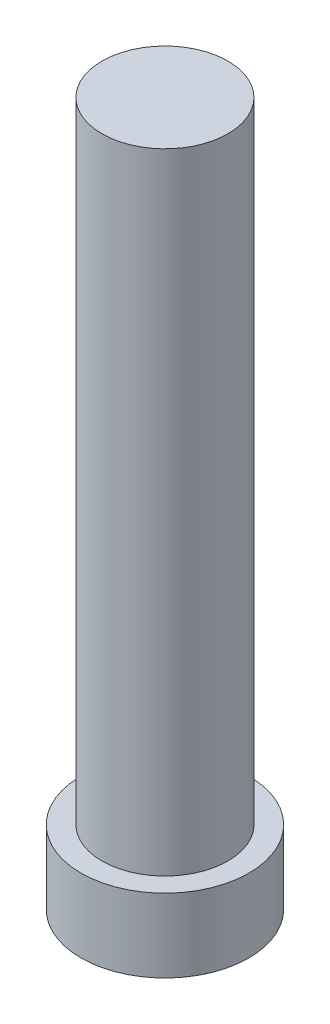
ISO-10303-21;
HEADER;
FILE_DESCRIPTION(('STEP AP214'),'2;1');
FILE_NAME('part.step','',(''),(''),'','','');
FILE_SCHEMA(('AUTOMOTIVE_DESIGN { 1 0 10303 214 1 1 1 1 }'));
ENDSEC;
DATA;
#1=APPLICATION_CONTEXT('core data for automotive mechanical design processes');
#2=APPLICATION_PROTOCOL_DEFINITION('international standard','automotive_design',2000,#1);
#3=PRODUCT_CONTEXT('',#1,'mechanical');
#4=PRODUCT('Part','Part','',(#3));
#5=PRODUCT_RELATED_PRODUCT_CATEGORY('part','',(#4));
#6=PRODUCT_DEFINITION_FORMATION('','',#4);
#7=PRODUCT_DEFINITION_CONTEXT('part definition',#1,'design');
#8=PRODUCT_DEFINITION('design','',#6,#7);
#9=PRODUCT_DEFINITION_SHAPE('','',#8);
#10=(LENGTH_UNIT() NAMED_UNIT(*) SI_UNIT(.MILLI.,.METRE.));
#11=(NAMED_UNIT(*) PLANE_ANGLE_UNIT() SI_UNIT($,.RADIAN.));
#12=(NAMED_UNIT(*) SI_UNIT($,.STERADIAN.) SOLID_ANGLE_UNIT());
#13=UNCERTAINTY_MEASURE_WITH_UNIT(LENGTH_MEASURE(1.E-05),#10,'distance_accuracy_value','');
#14=(GEOMETRIC_REPRESENTATION_CONTEXT(3) GLOBAL_UNCERTAINTY_ASSIGNED_CONTEXT((#13)) GLOBAL_UNIT_ASSIGNED_CONTEXT((#10,
#11,#12)) REPRESENTATION_CONTEXT('',''));
#15=CARTESIAN_POINT('',(0.,0.,0.));
#16=DIRECTION('',(0.,0.,1.));
#17=DIRECTION('',(1.,0.,0.));
#18=AXIS2_PLACEMENT_3D('',#15,#16,#17);
#19=CARTESIAN_POINT('',(0.,3.5,0.));
#20=DIRECTION('',(0.,-1.,0.));
#21=DIRECTION('',(0.,0.,-1.));
#22=AXIS2_PLACEMENT_3D('',#19,#20,#21);
#23=CYLINDRICAL_SURFACE('',#22,8.);
#24=CARTESIAN_POINT('',(0.,3.5,0.));
#25=DIRECTION('',(0.,1.,0.));
#26=DIRECTION('',(0.,0.,1.));
#27=AXIS2_PLACEMENT_3D('',#24,#25,#26);
#28=CIRCLE('',#27,8.);
#29=CARTESIAN_POINT('',(0.,3.5,8.));
#30=VERTEX_POINT('',#29);
#31=EDGE_CURVE('E10',#30,#30,#28,.T.);
#32=ORIENTED_EDGE('',*,*,#31,.F.);
#33=EDGE_LOOP('',(#32));
#34=FACE_BOUND('',#33,.T.);
#35=CARTESIAN_POINT('',(0.,-3.5,0.));
#36=DIRECTION('',(0.,1.,0.));
#37=DIRECTION('',(0.,0.,1.));
#38=AXIS2_PLACEMENT_3D('',#35,#36,#37);
#39=CIRCLE('',#38,8.);
#40=CARTESIAN_POINT('',(0.,-3.5,8.));
#41=VERTEX_POINT('',#40);
#42=EDGE_CURVE('E34',#41,#41,#39,.T.);
#43=ORIENTED_EDGE('',*,*,#42,.T.);
#44=EDGE_LOOP('',(#43));
#45=FACE_BOUND('',#44,.T.);
#46=ADVANCED_FACE('F31',(#34,#45),#23,.T.);
#47=CARTESIAN_POINT('',(0.,3.5,0.));
#48=DIRECTION('',(0.,1.,0.));
#49=DIRECTION('',(0.,0.,1.));
#50=AXIS2_PLACEMENT_3D('',#47,#48,#49);
#51=PLANE('',#50);
#52=CARTESIAN_POINT('',(0.,3.5,0.));
#53=DIRECTION('',(0.,1.,0.));
#54=DIRECTION('',(0.,0.,1.));
#55=AXIS2_PLACEMENT_3D('',#52,#53,#54);
#56=CIRCLE('',#55,6.);
#57=CARTESIAN_POINT('',(0.,3.5,6.));
#58=VERTEX_POINT('',#57);
#59=EDGE_CURVE('E43',#58,#58,#56,.T.);
#60=ORIENTED_EDGE('',*,*,#59,.F.);
#61=EDGE_LOOP('',(#60));
#62=FACE_BOUND('',#61,.T.);
#63=ORIENTED_EDGE('',*,*,#31,.T.);
#64=EDGE_LOOP('',(#63));
#65=FACE_BOUND('',#64,.T.);
#66=ADVANCED_FACE('F58',(#62,#65),#51,.T.);
#67=CARTESIAN_POINT('',(0.,-3.5,0.));
#68=DIRECTION('',(0.,1.,0.));
#69=DIRECTION('',(0.,0.,1.));
#70=AXIS2_PLACEMENT_3D('',#67,#68,#69);
#71=PLANE('',#70);
#72=ORIENTED_EDGE('',*,*,#42,.F.);
#73=EDGE_LOOP('',(#72));
#74=FACE_BOUND('',#73,.T.);
#75=ADVANCED_FACE('F54',(#74),#71,.F.);
#76=CARTESIAN_POINT('',(0.,63.5,0.));
#77=DIRECTION('',(0.,-1.,0.));
#78=DIRECTION('',(0.,0.,-1.));
#79=AXIS2_PLACEMENT_3D('',#76,#77,#78);
#80=CYLINDRICAL_SURFACE('',#79,6.);
#81=CARTESIAN_POINT('',(0.,63.5,0.));
#82=DIRECTION('',(0.,1.,0.));
#83=DIRECTION('',(0.,0.,1.));
#84=AXIS2_PLACEMENT_3D('',#81,#82,#83);
#85=CIRCLE('',#84,6.);
#86=CARTESIAN_POINT('',(0.,63.5,6.));
#87=VERTEX_POINT('',#86);
#88=EDGE_CURVE('E41',#87,#87,#85,.T.);
#89=ORIENTED_EDGE('',*,*,#88,.F.);
#90=EDGE_LOOP('',(#89));
#91=FACE_BOUND('',#90,.T.);
#92=ORIENTED_EDGE('',*,*,#59,.T.);
#93=EDGE_LOOP('',(#92));
#94=FACE_BOUND('',#93,.T.);
#95=ADVANCED_FACE('F51',(#91,#94),#80,.T.);
#96=CARTESIAN_POINT('',(0.,63.5,0.));
#97=DIRECTION('',(0.,1.,0.));
#98=DIRECTION('',(0.,0.,1.));
#99=AXIS2_PLACEMENT_3D('',#96,#97,#98);
#100=PLANE('',#99);
#101=ORIENTED_EDGE('',*,*,#88,.T.);
#102=EDGE_LOOP('',(#101));
#103=FACE_BOUND('',#102,.T.);
#104=ADVANCED_FACE('F49',(#103),#100,.T.);
#105=CLOSED_SHELL('',(#46,#66,#75,#95,#104));
#106=MANIFOLD_SOLID_BREP('B2',#105);
#107=ADVANCED_BREP_SHAPE_REPRESENTATION('',(#18,#106),#14);
#108=SHAPE_DEFINITION_REPRESENTATION(#9,#107);
ENDSEC;
END-ISO-10303-21;
